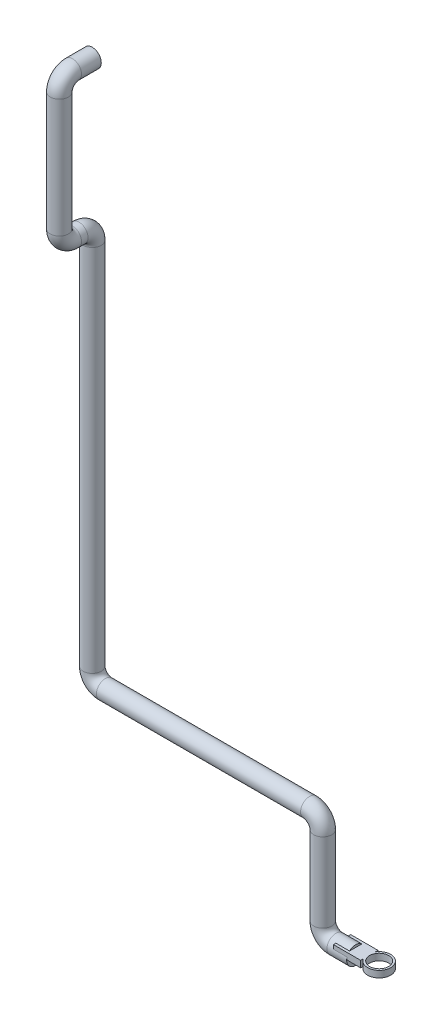
ISO-10303-21;
HEADER;
FILE_DESCRIPTION(('STEP AP214'),'2;1');
FILE_NAME('part.step','',(''),(''),'','','');
FILE_SCHEMA(('AUTOMOTIVE_DESIGN { 1 0 10303 214 1 1 1 1 }'));
ENDSEC;
DATA;
#1=APPLICATION_CONTEXT('core data for automotive mechanical design processes');
#2=APPLICATION_PROTOCOL_DEFINITION('international standard','automotive_design',2000,#1);
#3=PRODUCT_CONTEXT('',#1,'mechanical');
#4=PRODUCT('Part','Part','',(#3));
#5=PRODUCT_RELATED_PRODUCT_CATEGORY('part','',(#4));
#6=PRODUCT_DEFINITION_FORMATION('','',#4);
#7=PRODUCT_DEFINITION_CONTEXT('part definition',#1,'design');
#8=PRODUCT_DEFINITION('design','',#6,#7);
#9=PRODUCT_DEFINITION_SHAPE('','',#8);
#10=(LENGTH_UNIT() NAMED_UNIT(*) SI_UNIT(.MILLI.,.METRE.));
#11=(NAMED_UNIT(*) PLANE_ANGLE_UNIT() SI_UNIT($,.RADIAN.));
#12=(NAMED_UNIT(*) SI_UNIT($,.STERADIAN.) SOLID_ANGLE_UNIT());
#13=UNCERTAINTY_MEASURE_WITH_UNIT(LENGTH_MEASURE(1.E-05),#10,'distance_accuracy_value','');
#14=(GEOMETRIC_REPRESENTATION_CONTEXT(3) GLOBAL_UNCERTAINTY_ASSIGNED_CONTEXT((#13)) GLOBAL_UNIT_ASSIGNED_CONTEXT((#10,
#11,#12)) REPRESENTATION_CONTEXT('',''));
#15=CARTESIAN_POINT('',(0.,0.,0.));
#16=DIRECTION('',(0.,0.,1.));
#17=DIRECTION('',(1.,0.,0.));
#18=AXIS2_PLACEMENT_3D('',#15,#16,#17);
#19=CARTESIAN_POINT('',(0.,0.,0.));
#20=DIRECTION('',(1.,0.,0.));
#21=DIRECTION('',(0.,0.,-1.));
#22=AXIS2_PLACEMENT_3D('',#19,#20,#21);
#23=PLANE('',#22);
#24=DIRECTION('',(0.,0.,1.));
#25=VECTOR('',#24,1.);
#26=CARTESIAN_POINT('',(0.,10.,0.));
#27=LINE('',#26,#25);
#28=CARTESIAN_POINT('',(0.,10.,-9.36429388688757));
#29=VERTEX_POINT('',#28);
#30=CARTESIAN_POINT('',(0.,10.,9.36429388688757));
#31=VERTEX_POINT('',#30);
#32=EDGE_CURVE('E51',#29,#31,#27,.T.);
#33=ORIENTED_EDGE('',*,*,#32,.F.);
#34=CARTESIAN_POINT('',(0.,0.,0.));
#35=DIRECTION('',(1.,0.,0.));
#36=DIRECTION('',(0.,0.,-1.));
#37=AXIS2_PLACEMENT_3D('',#34,#35,#36);
#38=CIRCLE('',#37,13.7);
#39=EDGE_CURVE('E192',#29,#31,#38,.T.);
#40=ORIENTED_EDGE('',*,*,#39,.T.);
#41=EDGE_LOOP('',(#33,#40));
#42=FACE_BOUND('',#41,.T.);
#43=ADVANCED_FACE('F36',(#42),#23,.T.);
#44=CARTESIAN_POINT('',(0.,0.,0.));
#45=DIRECTION('',(-1.,0.,0.));
#46=DIRECTION('',(0.,0.,1.));
#47=AXIS2_PLACEMENT_3D('',#44,#45,#46);
#48=CYLINDRICAL_SURFACE('',#47,13.7);
#49=CARTESIAN_POINT('',(-30.,0.,0.));
#50=DIRECTION('',(1.,0.,0.));
#51=DIRECTION('',(0.,0.,-1.));
#52=AXIS2_PLACEMENT_3D('',#49,#50,#51);
#53=CIRCLE('',#52,13.7);
#54=CARTESIAN_POINT('',(-30.,-13.7,0.));
#55=VERTEX_POINT('',#54);
#56=EDGE_CURVE('E191',#55,#55,#53,.T.);
#57=ORIENTED_EDGE('',*,*,#56,.T.);
#58=EDGE_LOOP('',(#57));
#59=FACE_BOUND('',#58,.T.);
#60=CARTESIAN_POINT('',(-20.7288834551564,0.,0.));
#61=DIRECTION('',(1.,0.,0.));
#62=DIRECTION('',(0.,0.,-1.));
#63=AXIS2_PLACEMENT_3D('',#60,#61,#62);
#64=CIRCLE('',#63,13.7);
#65=CARTESIAN_POINT('',(-20.7288834551564,3.90404625856927,-13.1319618797403));
#66=VERTEX_POINT('',#65);
#67=CARTESIAN_POINT('',(-20.7288834551564,10.,-9.36429388688757));
#68=VERTEX_POINT('',#67);
#69=EDGE_CURVE('E235',#66,#68,#64,.T.);
#70=ORIENTED_EDGE('',*,*,#69,.F.);
#71=DIRECTION('',(-1.,0.,0.));
#72=VECTOR('',#71,1.);
#73=CARTESIAN_POINT('',(0.,3.90404625856927,-13.1319618797403));
#74=LINE('',#73,#72);
#75=CARTESIAN_POINT('',(0.,3.90404625856927,-13.1319618797403));
#76=VERTEX_POINT('',#75);
#77=EDGE_CURVE('E44',#66,#76,#74,.F.);
#78=ORIENTED_EDGE('',*,*,#77,.T.);
#79=CARTESIAN_POINT('',(0.,0.,-13.7));
#80=VERTEX_POINT('',#79);
#81=EDGE_CURVE('E189',#80,#76,#38,.T.);
#82=ORIENTED_EDGE('',*,*,#81,.F.);
#83=CARTESIAN_POINT('',(0.,3.90404625856924,13.1319618797403));
#84=VERTEX_POINT('',#83);
#85=EDGE_CURVE('E59',#84,#80,#38,.T.);
#86=ORIENTED_EDGE('',*,*,#85,.F.);
#87=DIRECTION('',(-1.,0.,0.));
#88=VECTOR('',#87,1.);
#89=CARTESIAN_POINT('',(0.,3.90404625856924,13.1319618797403));
#90=LINE('',#89,#88);
#91=CARTESIAN_POINT('',(-20.7288834551564,3.90404625856924,13.1319618797403));
#92=VERTEX_POINT('',#91);
#93=EDGE_CURVE('E234',#92,#84,#90,.F.);
#94=ORIENTED_EDGE('',*,*,#93,.F.);
#95=CARTESIAN_POINT('',(-20.7288834551564,10.,9.36429388688757));
#96=VERTEX_POINT('',#95);
#97=EDGE_CURVE('E232',#96,#92,#64,.T.);
#98=ORIENTED_EDGE('',*,*,#97,.F.);
#99=DIRECTION('',(-1.,0.,0.));
#100=VECTOR('',#99,1.);
#101=CARTESIAN_POINT('',(0.,10.,9.36429388688757));
#102=LINE('',#101,#100);
#103=EDGE_CURVE('E230',#96,#31,#102,.F.);
#104=ORIENTED_EDGE('',*,*,#103,.T.);
#105=ORIENTED_EDGE('',*,*,#39,.F.);
#106=DIRECTION('',(-1.,0.,0.));
#107=VECTOR('',#106,1.);
#108=CARTESIAN_POINT('',(0.,10.,-9.36429388688757));
#109=LINE('',#108,#107);
#110=EDGE_CURVE('E237',#29,#68,#109,.T.);
#111=ORIENTED_EDGE('',*,*,#110,.T.);
#112=EDGE_LOOP('',(#70,#78,#82,#86,#94,#98,#104,#105,#111));
#113=FACE_BOUND('',#112,.T.);
#114=ADVANCED_FACE('F247',(#59,#113),#48,.T.);
#115=DIRECTION('',(0.,1.,0.));
#116=VECTOR('',#115,1.);
#117=CARTESIAN_POINT('',(0.,0.,-13.1319618797403));
#118=LINE('',#117,#116);
#119=CARTESIAN_POINT('',(0.,0.,-13.1319618797403));
#120=VERTEX_POINT('',#119);
#121=EDGE_CURVE('E187',#120,#76,#118,.T.);
#122=ORIENTED_EDGE('',*,*,#121,.F.);
#123=DIRECTION('',(0.,0.,1.));
#124=VECTOR('',#123,1.);
#125=CARTESIAN_POINT('',(0.,0.,0.));
#126=LINE('',#125,#124);
#127=CARTESIAN_POINT('',(0.,0.,13.1319618797403));
#128=VERTEX_POINT('',#127);
#129=EDGE_CURVE('E11',#120,#128,#126,.T.);
#130=ORIENTED_EDGE('',*,*,#129,.T.);
#131=DIRECTION('',(0.,1.,0.));
#132=VECTOR('',#131,1.);
#133=CARTESIAN_POINT('',(0.,0.,13.1319618797403));
#134=LINE('',#133,#132);
#135=EDGE_CURVE('E185',#128,#84,#134,.T.);
#136=ORIENTED_EDGE('',*,*,#135,.T.);
#137=ORIENTED_EDGE('',*,*,#85,.T.);
#138=ORIENTED_EDGE('',*,*,#81,.T.);
#139=EDGE_LOOP('',(#122,#130,#136,#137,#138));
#140=FACE_BOUND('',#139,.T.);
#141=ADVANCED_FACE('F38',(#140),#23,.T.);
#142=CARTESIAN_POINT('',(-400.,980.,0.));
#143=DIRECTION('',(0.,0.,1.));
#144=DIRECTION('',(0.,-1.,0.));
#145=AXIS2_PLACEMENT_3D('',#142,#143,#144);
#146=PLANE('',#145);
#147=CARTESIAN_POINT('',(-400.,980.,0.));
#148=DIRECTION('',(0.,0.,1.));
#149=DIRECTION('',(0.,-1.,0.));
#150=AXIS2_PLACEMENT_3D('',#147,#148,#149);
#151=CIRCLE('',#150,13.7);
#152=CARTESIAN_POINT('',(-400.,966.3,0.));
#153=VERTEX_POINT('',#152);
#154=EDGE_CURVE('E228',#153,#153,#151,.T.);
#155=ORIENTED_EDGE('',*,*,#154,.F.);
#156=EDGE_LOOP('',(#155));
#157=FACE_BOUND('',#156,.T.);
#158=ADVANCED_FACE('F259',(#157),#146,.F.);
#159=CARTESIAN_POINT('',(-30.,20.,0.));
#160=DIRECTION('',(0.,0.,-1.));
#161=DIRECTION('',(-1.,0.,0.));
#162=AXIS2_PLACEMENT_3D('',#159,#160,#161);
#163=TOROIDAL_SURFACE('',#162,20.,13.7);
#164=CARTESIAN_POINT('',(-50.,20.,0.));
#165=DIRECTION('',(0.,-1.,0.));
#166=DIRECTION('',(0.,0.,-1.));
#167=AXIS2_PLACEMENT_3D('',#164,#165,#166);
#168=CIRCLE('',#167,13.7);
#169=CARTESIAN_POINT('',(-63.7,20.,0.));
#170=VERTEX_POINT('',#169);
#171=EDGE_CURVE('E195',#170,#170,#168,.T.);
#172=CARTESIAN_POINT('',(-30.,20.,0.));
#173=DIRECTION('',(0.,0.,-1.));
#174=DIRECTION('',(-1.,0.,0.));
#175=AXIS2_PLACEMENT_3D('',#172,#173,#174);
#176=CIRCLE('',#175,33.7);
#177=EDGE_CURVE('',#55,#170,#176,.T.);
#178=ORIENTED_EDGE('',*,*,#56,.F.);
#179=ORIENTED_EDGE('',*,*,#171,.T.);
#180=ORIENTED_EDGE('',*,*,#177,.T.);
#181=ORIENTED_EDGE('',*,*,#177,.F.);
#182=EDGE_LOOP('',(#178,#180,#179,#181));
#183=FACE_BOUND('',#182,.T.);
#184=ADVANCED_FACE('F263',(#183),#163,.T.);
#185=CARTESIAN_POINT('',(-50.,20.,0.));
#186=DIRECTION('',(0.,1.,0.));
#187=DIRECTION('',(0.,0.,1.));
#188=AXIS2_PLACEMENT_3D('',#185,#186,#187);
#189=CYLINDRICAL_SURFACE('',#188,13.7);
#190=CARTESIAN_POINT('',(-50.,140.,0.));
#191=DIRECTION('',(0.,-1.,0.));
#192=DIRECTION('',(0.,0.,-1.));
#193=AXIS2_PLACEMENT_3D('',#190,#191,#192);
#194=CIRCLE('',#193,13.7);
#195=CARTESIAN_POINT('',(-36.3,140.,0.));
#196=VERTEX_POINT('',#195);
#197=EDGE_CURVE('E198',#196,#196,#194,.T.);
#198=ORIENTED_EDGE('',*,*,#197,.T.);
#199=EDGE_LOOP('',(#198));
#200=FACE_BOUND('',#199,.T.);
#201=ORIENTED_EDGE('',*,*,#171,.F.);
#202=EDGE_LOOP('',(#201));
#203=FACE_BOUND('',#202,.T.);
#204=ADVANCED_FACE('F313',(#200,#203),#189,.T.);
#205=CARTESIAN_POINT('',(-70.,140.,0.));
#206=DIRECTION('',(0.,0.,1.));
#207=DIRECTION('',(1.,0.,0.));
#208=AXIS2_PLACEMENT_3D('',#205,#206,#207);
#209=TOROIDAL_SURFACE('',#208,20.,13.7);
#210=CARTESIAN_POINT('',(-70.,160.,0.));
#211=DIRECTION('',(1.,0.,0.));
#212=DIRECTION('',(0.,0.,-1.));
#213=AXIS2_PLACEMENT_3D('',#210,#211,#212);
#214=CIRCLE('',#213,13.7);
#215=CARTESIAN_POINT('',(-70.,173.7,0.));
#216=VERTEX_POINT('',#215);
#217=EDGE_CURVE('E201',#216,#216,#214,.T.);
#218=CARTESIAN_POINT('',(-70.,140.,0.));
#219=DIRECTION('',(0.,0.,1.));
#220=DIRECTION('',(1.,0.,0.));
#221=AXIS2_PLACEMENT_3D('',#218,#219,#220);
#222=CIRCLE('',#221,33.7);
#223=EDGE_CURVE('',#196,#216,#222,.T.);
#224=ORIENTED_EDGE('',*,*,#197,.F.);
#225=ORIENTED_EDGE('',*,*,#217,.T.);
#226=ORIENTED_EDGE('',*,*,#223,.T.);
#227=ORIENTED_EDGE('',*,*,#223,.F.);
#228=EDGE_LOOP('',(#224,#226,#225,#227));
#229=FACE_BOUND('',#228,.T.);
#230=ADVANCED_FACE('F317',(#229),#209,.T.);
#231=CARTESIAN_POINT('',(-70.,160.,0.));
#232=DIRECTION('',(-1.,0.,0.));
#233=DIRECTION('',(0.,0.,1.));
#234=AXIS2_PLACEMENT_3D('',#231,#232,#233);
#235=CYLINDRICAL_SURFACE('',#234,13.7);
#236=CARTESIAN_POINT('',(-380.,160.,0.));
#237=DIRECTION('',(1.,0.,0.));
#238=DIRECTION('',(0.,0.,-1.));
#239=AXIS2_PLACEMENT_3D('',#236,#237,#238);
#240=CIRCLE('',#239,13.7);
#241=CARTESIAN_POINT('',(-380.,146.3,0.));
#242=VERTEX_POINT('',#241);
#243=EDGE_CURVE('E204',#242,#242,#240,.T.);
#244=ORIENTED_EDGE('',*,*,#243,.T.);
#245=EDGE_LOOP('',(#244));
#246=FACE_BOUND('',#245,.T.);
#247=ORIENTED_EDGE('',*,*,#217,.F.);
#248=EDGE_LOOP('',(#247));
#249=FACE_BOUND('',#248,.T.);
#250=ADVANCED_FACE('F321',(#246,#249),#235,.T.);
#251=CARTESIAN_POINT('',(-380.,180.,0.));
#252=DIRECTION('',(0.,0.,-1.));
#253=DIRECTION('',(-1.,0.,0.));
#254=AXIS2_PLACEMENT_3D('',#251,#252,#253);
#255=TOROIDAL_SURFACE('',#254,20.,13.7);
#256=CARTESIAN_POINT('',(-400.,180.,0.));
#257=DIRECTION('',(0.,-1.,0.));
#258=DIRECTION('',(0.,0.,-1.));
#259=AXIS2_PLACEMENT_3D('',#256,#257,#258);
#260=CIRCLE('',#259,13.7);
#261=CARTESIAN_POINT('',(-413.7,180.,0.));
#262=VERTEX_POINT('',#261);
#263=EDGE_CURVE('E207',#262,#262,#260,.T.);
#264=CARTESIAN_POINT('',(-380.,180.,0.));
#265=DIRECTION('',(0.,0.,-1.));
#266=DIRECTION('',(-1.,0.,0.));
#267=AXIS2_PLACEMENT_3D('',#264,#265,#266);
#268=CIRCLE('',#267,33.7);
#269=EDGE_CURVE('',#242,#262,#268,.T.);
#270=ORIENTED_EDGE('',*,*,#243,.F.);
#271=ORIENTED_EDGE('',*,*,#263,.T.);
#272=ORIENTED_EDGE('',*,*,#269,.T.);
#273=ORIENTED_EDGE('',*,*,#269,.F.);
#274=EDGE_LOOP('',(#270,#272,#271,#273));
#275=FACE_BOUND('',#274,.T.);
#276=ADVANCED_FACE('F325',(#275),#255,.T.);
#277=CARTESIAN_POINT('',(-400.,180.,0.));
#278=DIRECTION('',(0.,1.,0.));
#279=DIRECTION('',(0.,0.,1.));
#280=AXIS2_PLACEMENT_3D('',#277,#278,#279);
#281=CYLINDRICAL_SURFACE('',#280,13.7);
#282=CARTESIAN_POINT('',(-400.,740.,0.));
#283=DIRECTION('',(0.,-1.,0.));
#284=DIRECTION('',(0.,0.,-1.));
#285=AXIS2_PLACEMENT_3D('',#282,#283,#284);
#286=CIRCLE('',#285,13.7);
#287=CARTESIAN_POINT('',(-400.,740.,-13.7));
#288=VERTEX_POINT('',#287);
#289=EDGE_CURVE('E210',#288,#288,#286,.T.);
#290=ORIENTED_EDGE('',*,*,#289,.T.);
#291=EDGE_LOOP('',(#290));
#292=FACE_BOUND('',#291,.T.);
#293=ORIENTED_EDGE('',*,*,#263,.F.);
#294=EDGE_LOOP('',(#293));
#295=FACE_BOUND('',#294,.T.);
#296=ADVANCED_FACE('F329',(#292,#295),#281,.T.);
#297=CARTESIAN_POINT('',(-400.,740.,20.));
#298=DIRECTION('',(1.,0.,0.));
#299=DIRECTION('',(0.,0.,-1.));
#300=AXIS2_PLACEMENT_3D('',#297,#298,#299);
#301=TOROIDAL_SURFACE('',#300,20.,13.7);
#302=CARTESIAN_POINT('',(-400.,760.,20.));
#303=DIRECTION('',(0.,0.,-1.));
#304=DIRECTION('',(0.,1.,0.));
#305=AXIS2_PLACEMENT_3D('',#302,#303,#304);
#306=CIRCLE('',#305,13.7);
#307=CARTESIAN_POINT('',(-400.,773.7,20.));
#308=VERTEX_POINT('',#307);
#309=EDGE_CURVE('E213',#308,#308,#306,.T.);
#310=CARTESIAN_POINT('',(-400.,740.,20.));
#311=DIRECTION('',(1.,0.,0.));
#312=DIRECTION('',(0.,0.,-1.));
#313=AXIS2_PLACEMENT_3D('',#310,#311,#312);
#314=CIRCLE('',#313,33.7);
#315=EDGE_CURVE('',#288,#308,#314,.T.);
#316=ORIENTED_EDGE('',*,*,#289,.F.);
#317=ORIENTED_EDGE('',*,*,#309,.T.);
#318=ORIENTED_EDGE('',*,*,#315,.T.);
#319=ORIENTED_EDGE('',*,*,#315,.F.);
#320=EDGE_LOOP('',(#316,#318,#317,#319));
#321=FACE_BOUND('',#320,.T.);
#322=ADVANCED_FACE('F333',(#321),#301,.T.);
#323=CARTESIAN_POINT('',(-400.,760.,20.));
#324=DIRECTION('',(0.,0.,1.));
#325=DIRECTION('',(1.,0.,0.));
#326=AXIS2_PLACEMENT_3D('',#323,#324,#325);
#327=CYLINDRICAL_SURFACE('',#326,13.7);
#328=CARTESIAN_POINT('',(-400.,760.,30.));
#329=DIRECTION('',(0.,0.,-1.));
#330=DIRECTION('',(0.,1.,0.));
#331=AXIS2_PLACEMENT_3D('',#328,#329,#330);
#332=CIRCLE('',#331,13.7);
#333=CARTESIAN_POINT('',(-400.,746.3,30.));
#334=VERTEX_POINT('',#333);
#335=EDGE_CURVE('E216',#334,#334,#332,.T.);
#336=ORIENTED_EDGE('',*,*,#335,.T.);
#337=EDGE_LOOP('',(#336));
#338=FACE_BOUND('',#337,.T.);
#339=ORIENTED_EDGE('',*,*,#309,.F.);
#340=EDGE_LOOP('',(#339));
#341=FACE_BOUND('',#340,.T.);
#342=ADVANCED_FACE('F337',(#338,#341),#327,.T.);
#343=CARTESIAN_POINT('',(-400.,780.,30.));
#344=DIRECTION('',(-1.,0.,0.));
#345=DIRECTION('',(0.,0.,1.));
#346=AXIS2_PLACEMENT_3D('',#343,#344,#345);
#347=TOROIDAL_SURFACE('',#346,20.,13.7);
#348=CARTESIAN_POINT('',(-400.,780.,50.));
#349=DIRECTION('',(0.,-1.,0.));
#350=DIRECTION('',(0.,0.,-1.));
#351=AXIS2_PLACEMENT_3D('',#348,#349,#350);
#352=CIRCLE('',#351,13.7);
#353=CARTESIAN_POINT('',(-400.,780.,63.7));
#354=VERTEX_POINT('',#353);
#355=EDGE_CURVE('E219',#354,#354,#352,.T.);
#356=CARTESIAN_POINT('',(-400.,780.,30.));
#357=DIRECTION('',(-1.,0.,0.));
#358=DIRECTION('',(0.,0.,1.));
#359=AXIS2_PLACEMENT_3D('',#356,#357,#358);
#360=CIRCLE('',#359,33.7);
#361=EDGE_CURVE('',#334,#354,#360,.T.);
#362=ORIENTED_EDGE('',*,*,#335,.F.);
#363=ORIENTED_EDGE('',*,*,#355,.T.);
#364=ORIENTED_EDGE('',*,*,#361,.T.);
#365=ORIENTED_EDGE('',*,*,#361,.F.);
#366=EDGE_LOOP('',(#362,#364,#363,#365));
#367=FACE_BOUND('',#366,.T.);
#368=ADVANCED_FACE('F341',(#367),#347,.T.);
#369=CARTESIAN_POINT('',(-400.,780.,50.));
#370=DIRECTION('',(0.,1.,0.));
#371=DIRECTION('',(0.,0.,1.));
#372=AXIS2_PLACEMENT_3D('',#369,#370,#371);
#373=CYLINDRICAL_SURFACE('',#372,13.7);
#374=CARTESIAN_POINT('',(-400.,960.,50.));
#375=DIRECTION('',(0.,-1.,0.));
#376=DIRECTION('',(0.,0.,-1.));
#377=AXIS2_PLACEMENT_3D('',#374,#375,#376);
#378=CIRCLE('',#377,13.7);
#379=CARTESIAN_POINT('',(-400.,960.,63.7));
#380=VERTEX_POINT('',#379);
#381=EDGE_CURVE('E222',#380,#380,#378,.T.);
#382=ORIENTED_EDGE('',*,*,#381,.T.);
#383=EDGE_LOOP('',(#382));
#384=FACE_BOUND('',#383,.T.);
#385=ORIENTED_EDGE('',*,*,#355,.F.);
#386=EDGE_LOOP('',(#385));
#387=FACE_BOUND('',#386,.T.);
#388=ADVANCED_FACE('F345',(#384,#387),#373,.T.);
#389=CARTESIAN_POINT('',(-400.,960.,30.));
#390=DIRECTION('',(-1.,0.,0.));
#391=DIRECTION('',(0.,0.,1.));
#392=AXIS2_PLACEMENT_3D('',#389,#390,#391);
#393=TOROIDAL_SURFACE('',#392,20.,13.7);
#394=CARTESIAN_POINT('',(-400.,980.,30.));
#395=DIRECTION('',(0.,0.,1.));
#396=DIRECTION('',(0.,-1.,0.));
#397=AXIS2_PLACEMENT_3D('',#394,#395,#396);
#398=CIRCLE('',#397,13.7);
#399=CARTESIAN_POINT('',(-400.,993.7,30.));
#400=VERTEX_POINT('',#399);
#401=EDGE_CURVE('E225',#400,#400,#398,.T.);
#402=CARTESIAN_POINT('',(-400.,960.,30.));
#403=DIRECTION('',(-1.,0.,0.));
#404=DIRECTION('',(0.,0.,1.));
#405=AXIS2_PLACEMENT_3D('',#402,#403,#404);
#406=CIRCLE('',#405,33.7);
#407=EDGE_CURVE('',#380,#400,#406,.T.);
#408=ORIENTED_EDGE('',*,*,#381,.F.);
#409=ORIENTED_EDGE('',*,*,#401,.T.);
#410=ORIENTED_EDGE('',*,*,#407,.T.);
#411=ORIENTED_EDGE('',*,*,#407,.F.);
#412=EDGE_LOOP('',(#408,#410,#409,#411));
#413=FACE_BOUND('',#412,.T.);
#414=ADVANCED_FACE('F275',(#413),#393,.T.);
#415=CARTESIAN_POINT('',(-400.,980.,30.));
#416=DIRECTION('',(0.,0.,-1.));
#417=DIRECTION('',(-1.,0.,0.));
#418=AXIS2_PLACEMENT_3D('',#415,#416,#417);
#419=CYLINDRICAL_SURFACE('',#418,13.7);
#420=ORIENTED_EDGE('',*,*,#154,.T.);
#421=EDGE_LOOP('',(#420));
#422=FACE_BOUND('',#421,.T.);
#423=ORIENTED_EDGE('',*,*,#401,.F.);
#424=EDGE_LOOP('',(#423));
#425=FACE_BOUND('',#424,.T.);
#426=ADVANCED_FACE('F257',(#422,#425),#419,.T.);
#427=CARTESIAN_POINT('',(-20.7288834551564,10.,0.));
#428=DIRECTION('',(1.,0.,0.));
#429=DIRECTION('',(0.,0.,-1.));
#430=AXIS2_PLACEMENT_3D('',#427,#428,#429);
#431=PLANE('',#430);
#432=DIRECTION('',(0.,-1.,0.));
#433=VECTOR('',#432,1.);
#434=CARTESIAN_POINT('',(-20.7288834551564,10.,-13.1319618797403));
#435=LINE('',#434,#433);
#436=CARTESIAN_POINT('',(-20.7288834551564,10.,-13.1319618797403));
#437=VERTEX_POINT('',#436);
#438=EDGE_CURVE('E177',#437,#66,#435,.T.);
#439=ORIENTED_EDGE('',*,*,#438,.T.);
#440=ORIENTED_EDGE('',*,*,#69,.T.);
#441=DIRECTION('',(0.,0.,1.));
#442=VECTOR('',#441,1.);
#443=CARTESIAN_POINT('',(-20.7288834551564,10.,0.));
#444=LINE('',#443,#442);
#445=EDGE_CURVE('E156',#437,#68,#444,.T.);
#446=ORIENTED_EDGE('',*,*,#445,.F.);
#447=EDGE_LOOP('',(#439,#440,#446));
#448=FACE_BOUND('',#447,.T.);
#449=ADVANCED_FACE('F244',(#448),#431,.F.);
#450=CARTESIAN_POINT('',(0.,10.,0.));
#451=DIRECTION('',(0.,1.,0.));
#452=DIRECTION('',(0.,0.,1.));
#453=AXIS2_PLACEMENT_3D('',#450,#451,#452);
#454=PLANE('',#453);
#455=CARTESIAN_POINT('',(35.5973931452008,10.,0.));
#456=DIRECTION('',(0.,1.,0.));
#457=DIRECTION('',(0.,0.,1.));
#458=AXIS2_PLACEMENT_3D('',#455,#456,#457);
#459=CIRCLE('',#458,14.4660231880308);
#460=CARTESIAN_POINT('',(35.5973931452008,10.,14.4660231880308));
#461=VERTEX_POINT('',#460);
#462=EDGE_CURVE('E160',#461,#461,#459,.T.);
#463=ORIENTED_EDGE('',*,*,#462,.F.);
#464=EDGE_LOOP('',(#463));
#465=FACE_BOUND('',#464,.T.);
#466=ORIENTED_EDGE('',*,*,#110,.F.);
#467=ORIENTED_EDGE('',*,*,#32,.T.);
#468=ORIENTED_EDGE('',*,*,#103,.F.);
#469=CARTESIAN_POINT('',(-20.7288834551564,10.,13.1319618797403));
#470=VERTEX_POINT('',#469);
#471=EDGE_CURVE('E155',#96,#470,#444,.T.);
#472=ORIENTED_EDGE('',*,*,#471,.T.);
#473=DIRECTION('',(1.,0.,0.));
#474=VECTOR('',#473,1.);
#475=CARTESIAN_POINT('',(0.,10.,13.1319618797403));
#476=LINE('',#475,#474);
#477=CARTESIAN_POINT('',(20.7288834551564,10.,13.1319618797403));
#478=VERTEX_POINT('',#477);
#479=EDGE_CURVE('E143',#470,#478,#476,.T.);
#480=ORIENTED_EDGE('',*,*,#479,.T.);
#481=DIRECTION('',(0.,0.,1.));
#482=VECTOR('',#481,1.);
#483=CARTESIAN_POINT('',(20.7288834551564,10.,0.));
#484=LINE('',#483,#482);
#485=CARTESIAN_POINT('',(20.7288834551564,10.,9.22916137019266));
#486=VERTEX_POINT('',#485);
#487=EDGE_CURVE('E126',#486,#478,#484,.T.);
#488=ORIENTED_EDGE('',*,*,#487,.F.);
#489=CARTESIAN_POINT('',(35.5973931452008,10.,0.));
#490=DIRECTION('',(0.,1.,0.));
#491=DIRECTION('',(0.,0.,1.));
#492=AXIS2_PLACEMENT_3D('',#489,#490,#491);
#493=CIRCLE('',#492,17.5);
#494=CARTESIAN_POINT('',(20.7288834551564,10.,-9.22916137019265));
#495=VERTEX_POINT('',#494);
#496=EDGE_CURVE('E135',#486,#495,#493,.T.);
#497=ORIENTED_EDGE('',*,*,#496,.T.);
#498=DIRECTION('',(0.,0.,1.));
#499=VECTOR('',#498,1.);
#500=CARTESIAN_POINT('',(20.7288834551564,10.,0.));
#501=LINE('',#500,#499);
#502=CARTESIAN_POINT('',(20.7288834551564,10.,-13.1319618797403));
#503=VERTEX_POINT('',#502);
#504=EDGE_CURVE('E139',#503,#495,#501,.T.);
#505=ORIENTED_EDGE('',*,*,#504,.F.);
#506=DIRECTION('',(1.,0.,0.));
#507=VECTOR('',#506,1.);
#508=CARTESIAN_POINT('',(0.,10.,-13.1319618797403));
#509=LINE('',#508,#507);
#510=EDGE_CURVE('E152',#437,#503,#509,.T.);
#511=ORIENTED_EDGE('',*,*,#510,.F.);
#512=ORIENTED_EDGE('',*,*,#445,.T.);
#513=EDGE_LOOP('',(#466,#467,#468,#472,#480,#488,#497,#505,#511,#512));
#514=FACE_BOUND('',#513,.T.);
#515=ADVANCED_FACE('F141',(#465,#514),#454,.T.);
#516=CARTESIAN_POINT('',(20.7288834551564,10.,0.));
#517=DIRECTION('',(1.,0.,0.));
#518=DIRECTION('',(0.,0.,-1.));
#519=AXIS2_PLACEMENT_3D('',#516,#517,#518);
#520=PLANE('',#519);
#521=DIRECTION('',(0.,0.,1.));
#522=VECTOR('',#521,1.);
#523=CARTESIAN_POINT('',(20.7288834551564,0.,0.));
#524=LINE('',#523,#522);
#525=CARTESIAN_POINT('',(20.7288834551564,0.,9.22916137019266));
#526=VERTEX_POINT('',#525);
#527=CARTESIAN_POINT('',(20.7288834551564,0.,13.1319618797403));
#528=VERTEX_POINT('',#527);
#529=EDGE_CURVE('E128',#526,#528,#524,.T.);
#530=ORIENTED_EDGE('',*,*,#529,.F.);
#531=DIRECTION('',(0.,-1.,0.));
#532=VECTOR('',#531,1.);
#533=CARTESIAN_POINT('',(20.7288834551564,10.,9.22916137019266));
#534=LINE('',#533,#532);
#535=EDGE_CURVE('E121',#486,#526,#534,.T.);
#536=ORIENTED_EDGE('',*,*,#535,.F.);
#537=ORIENTED_EDGE('',*,*,#487,.T.);
#538=DIRECTION('',(0.,-1.,0.));
#539=VECTOR('',#538,1.);
#540=CARTESIAN_POINT('',(20.7288834551564,10.,13.1319618797403));
#541=LINE('',#540,#539);
#542=EDGE_CURVE('E163',#478,#528,#541,.T.);
#543=ORIENTED_EDGE('',*,*,#542,.T.);
#544=EDGE_LOOP('',(#530,#536,#537,#543));
#545=FACE_BOUND('',#544,.T.);
#546=ADVANCED_FACE('F123',(#545),#520,.T.);
#547=CARTESIAN_POINT('',(35.5973931452008,10.,0.));
#548=DIRECTION('',(0.,-1.,0.));
#549=DIRECTION('',(0.,0.,-1.));
#550=AXIS2_PLACEMENT_3D('',#547,#548,#549);
#551=CYLINDRICAL_SURFACE('',#550,17.5);
#552=CARTESIAN_POINT('',(35.5973931452008,0.,0.));
#553=DIRECTION('',(0.,1.,0.));
#554=DIRECTION('',(0.,0.,1.));
#555=AXIS2_PLACEMENT_3D('',#552,#553,#554);
#556=CIRCLE('',#555,17.5);
#557=CARTESIAN_POINT('',(20.7288834551564,0.,-9.22916137019265));
#558=VERTEX_POINT('',#557);
#559=EDGE_CURVE('E165',#526,#558,#556,.T.);
#560=ORIENTED_EDGE('',*,*,#559,.T.);
#561=DIRECTION('',(0.,-1.,0.));
#562=VECTOR('',#561,1.);
#563=CARTESIAN_POINT('',(20.7288834551564,10.,-9.22916137019265));
#564=LINE('',#563,#562);
#565=EDGE_CURVE('E132',#495,#558,#564,.T.);
#566=ORIENTED_EDGE('',*,*,#565,.F.);
#567=ORIENTED_EDGE('',*,*,#496,.F.);
#568=ORIENTED_EDGE('',*,*,#535,.T.);
#569=EDGE_LOOP('',(#560,#566,#567,#568));
#570=FACE_BOUND('',#569,.T.);
#571=ADVANCED_FACE('F136',(#570),#551,.T.);
#572=CARTESIAN_POINT('',(20.7288834551564,10.,0.));
#573=DIRECTION('',(1.,0.,0.));
#574=DIRECTION('',(0.,0.,-1.));
#575=AXIS2_PLACEMENT_3D('',#572,#573,#574);
#576=PLANE('',#575);
#577=DIRECTION('',(0.,0.,1.));
#578=VECTOR('',#577,1.);
#579=CARTESIAN_POINT('',(20.7288834551564,0.,0.));
#580=LINE('',#579,#578);
#581=CARTESIAN_POINT('',(20.7288834551564,0.,-13.1319618797403));
#582=VERTEX_POINT('',#581);
#583=EDGE_CURVE('E167',#582,#558,#580,.T.);
#584=ORIENTED_EDGE('',*,*,#583,.F.);
#585=DIRECTION('',(0.,-1.,0.));
#586=VECTOR('',#585,1.);
#587=CARTESIAN_POINT('',(20.7288834551564,10.,-13.1319618797403));
#588=LINE('',#587,#586);
#589=EDGE_CURVE('E180',#503,#582,#588,.T.);
#590=ORIENTED_EDGE('',*,*,#589,.F.);
#591=ORIENTED_EDGE('',*,*,#504,.T.);
#592=ORIENTED_EDGE('',*,*,#565,.T.);
#593=EDGE_LOOP('',(#584,#590,#591,#592));
#594=FACE_BOUND('',#593,.T.);
#595=ADVANCED_FACE('F290',(#594),#576,.T.);
#596=CARTESIAN_POINT('',(0.,10.,-13.1319618797403));
#597=DIRECTION('',(0.,0.,-1.));
#598=DIRECTION('',(-1.,0.,0.));
#599=AXIS2_PLACEMENT_3D('',#596,#597,#598);
#600=PLANE('',#599);
#601=DIRECTION('',(1.,0.,0.));
#602=VECTOR('',#601,1.);
#603=CARTESIAN_POINT('',(0.,0.,-13.1319618797403));
#604=LINE('',#603,#602);
#605=EDGE_CURVE('E170',#120,#582,#604,.T.);
#606=ORIENTED_EDGE('',*,*,#605,.F.);
#607=ORIENTED_EDGE('',*,*,#121,.T.);
#608=ORIENTED_EDGE('',*,*,#77,.F.);
#609=ORIENTED_EDGE('',*,*,#438,.F.);
#610=ORIENTED_EDGE('',*,*,#510,.T.);
#611=ORIENTED_EDGE('',*,*,#589,.T.);
#612=EDGE_LOOP('',(#606,#607,#608,#609,#610,#611));
#613=FACE_BOUND('',#612,.T.);
#614=ADVANCED_FACE('F282',(#613),#600,.T.);
#615=ORIENTED_EDGE('',*,*,#471,.F.);
#616=ORIENTED_EDGE('',*,*,#97,.T.);
#617=DIRECTION('',(0.,-1.,0.));
#618=VECTOR('',#617,1.);
#619=CARTESIAN_POINT('',(-20.7288834551564,10.,13.1319618797403));
#620=LINE('',#619,#618);
#621=EDGE_CURVE('E174',#470,#92,#620,.T.);
#622=ORIENTED_EDGE('',*,*,#621,.F.);
#623=EDGE_LOOP('',(#615,#616,#622));
#624=FACE_BOUND('',#623,.T.);
#625=ADVANCED_FACE('F268',(#624),#431,.F.);
#626=CARTESIAN_POINT('',(0.,10.,13.1319618797403));
#627=DIRECTION('',(0.,0.,-1.));
#628=DIRECTION('',(-1.,0.,0.));
#629=AXIS2_PLACEMENT_3D('',#626,#627,#628);
#630=PLANE('',#629);
#631=ORIENTED_EDGE('',*,*,#135,.F.);
#632=DIRECTION('',(1.,0.,0.));
#633=VECTOR('',#632,1.);
#634=CARTESIAN_POINT('',(0.,0.,13.1319618797403));
#635=LINE('',#634,#633);
#636=EDGE_CURVE('E148',#128,#528,#635,.T.);
#637=ORIENTED_EDGE('',*,*,#636,.T.);
#638=ORIENTED_EDGE('',*,*,#542,.F.);
#639=ORIENTED_EDGE('',*,*,#479,.F.);
#640=ORIENTED_EDGE('',*,*,#621,.T.);
#641=ORIENTED_EDGE('',*,*,#93,.T.);
#642=EDGE_LOOP('',(#631,#637,#638,#639,#640,#641));
#643=FACE_BOUND('',#642,.T.);
#644=ADVANCED_FACE('F281',(#643),#630,.F.);
#645=CARTESIAN_POINT('',(35.5973931452008,10.,0.));
#646=DIRECTION('',(0.,-1.,0.));
#647=DIRECTION('',(0.,0.,-1.));
#648=AXIS2_PLACEMENT_3D('',#645,#646,#647);
#649=CYLINDRICAL_SURFACE('',#648,14.4660231880308);
#650=ORIENTED_EDGE('',*,*,#462,.T.);
#651=EDGE_LOOP('',(#650));
#652=FACE_BOUND('',#651,.T.);
#653=CARTESIAN_POINT('',(35.5973931452008,0.,0.));
#654=DIRECTION('',(0.,1.,0.));
#655=DIRECTION('',(0.,0.,1.));
#656=AXIS2_PLACEMENT_3D('',#653,#654,#655);
#657=CIRCLE('',#656,14.4660231880308);
#658=CARTESIAN_POINT('',(35.5973931452008,0.,14.4660231880308));
#659=VERTEX_POINT('',#658);
#660=EDGE_CURVE('E145',#659,#659,#657,.T.);
#661=ORIENTED_EDGE('',*,*,#660,.F.);
#662=EDGE_LOOP('',(#661));
#663=FACE_BOUND('',#662,.T.);
#664=ADVANCED_FACE('F288',(#652,#663),#649,.F.);
#665=CARTESIAN_POINT('',(0.,0.,0.));
#666=DIRECTION('',(0.,1.,0.));
#667=DIRECTION('',(0.,0.,1.));
#668=AXIS2_PLACEMENT_3D('',#665,#666,#667);
#669=PLANE('',#668);
#670=ORIENTED_EDGE('',*,*,#129,.F.);
#671=ORIENTED_EDGE('',*,*,#605,.T.);
#672=ORIENTED_EDGE('',*,*,#583,.T.);
#673=ORIENTED_EDGE('',*,*,#559,.F.);
#674=ORIENTED_EDGE('',*,*,#529,.T.);
#675=ORIENTED_EDGE('',*,*,#636,.F.);
#676=EDGE_LOOP('',(#670,#671,#672,#673,#674,#675));
#677=FACE_BOUND('',#676,.T.);
#678=ORIENTED_EDGE('',*,*,#660,.T.);
#679=EDGE_LOOP('',(#678));
#680=FACE_BOUND('',#679,.T.);
#681=ADVANCED_FACE('F298',(#677,#680),#669,.F.);
#682=CLOSED_SHELL('',(#43,#114,#141,#158,#184,#204,#230,#250,#276,#296,#322,#342,#368,#388,#414,
#426,#449,#515,#546,#571,#595,#614,#625,#644,#664,#681));
#683=MANIFOLD_SOLID_BREP('B2',#682);
#684=ADVANCED_BREP_SHAPE_REPRESENTATION('',(#18,#683),#14);
#685=SHAPE_DEFINITION_REPRESENTATION(#9,#684);
ENDSEC;
END-ISO-10303-21;
